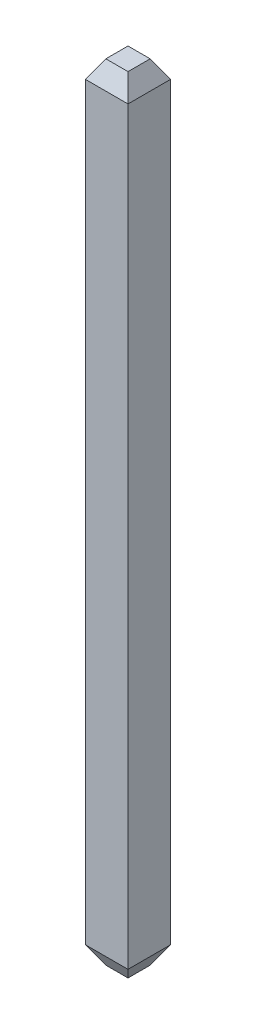
ISO-10303-21;
HEADER;
FILE_DESCRIPTION(('STEP AP214'),'2;1');
FILE_NAME('part.step','',(''),(''),'','','');
FILE_SCHEMA(('AUTOMOTIVE_DESIGN { 1 0 10303 214 1 1 1 1 }'));
ENDSEC;
DATA;
#1=APPLICATION_CONTEXT('core data for automotive mechanical design processes');
#2=APPLICATION_PROTOCOL_DEFINITION('international standard','automotive_design',2000,#1);
#3=PRODUCT_CONTEXT('',#1,'mechanical');
#4=PRODUCT('Part','Part','',(#3));
#5=PRODUCT_RELATED_PRODUCT_CATEGORY('part','',(#4));
#6=PRODUCT_DEFINITION_FORMATION('','',#4);
#7=PRODUCT_DEFINITION_CONTEXT('part definition',#1,'design');
#8=PRODUCT_DEFINITION('design','',#6,#7);
#9=PRODUCT_DEFINITION_SHAPE('','',#8);
#10=(LENGTH_UNIT() NAMED_UNIT(*) SI_UNIT(.MILLI.,.METRE.));
#11=(NAMED_UNIT(*) PLANE_ANGLE_UNIT() SI_UNIT($,.RADIAN.));
#12=(NAMED_UNIT(*) SI_UNIT($,.STERADIAN.) SOLID_ANGLE_UNIT());
#13=UNCERTAINTY_MEASURE_WITH_UNIT(LENGTH_MEASURE(1.E-05),#10,'distance_accuracy_value','');
#14=(GEOMETRIC_REPRESENTATION_CONTEXT(3) GLOBAL_UNCERTAINTY_ASSIGNED_CONTEXT((#13)) GLOBAL_UNIT_ASSIGNED_CONTEXT((#10,
#11,#12)) REPRESENTATION_CONTEXT('',''));
#15=CARTESIAN_POINT('',(0.,0.,0.));
#16=DIRECTION('',(0.,0.,1.));
#17=DIRECTION('',(1.,0.,0.));
#18=AXIS2_PLACEMENT_3D('',#15,#16,#17);
#19=CARTESIAN_POINT('',(4.7625,-5.58,1.105));
#20=DIRECTION('',(0.,0.50000000000019,0.866025403784329));
#21=DIRECTION('',(1.,0.,0.));
#22=AXIS2_PLACEMENT_3D('',#19,#20,#21);
#23=PLANE('',#22);
#24=DIRECTION('',(-0.44721359550015,0.774596669241261,-0.44721359550015));
#25=VECTOR('',#24,1.);
#26=CARTESIAN_POINT('',(4.915,-5.58,1.105));
#27=LINE('',#26,#25);
#28=CARTESIAN_POINT('',(4.915,-5.58,1.105));
#29=VERTEX_POINT('',#28);
#30=CARTESIAN_POINT('',(4.7625,-5.31586225185,0.9525));
#31=VERTEX_POINT('',#30);
#32=EDGE_CURVE('E168',#29,#31,#27,.T.);
#33=ORIENTED_EDGE('',*,*,#32,.T.);
#34=DIRECTION('',(1.,0.,0.));
#35=VECTOR('',#34,1.);
#36=CARTESIAN_POINT('',(4.7625,-5.31586225185,0.9525));
#37=LINE('',#36,#35);
#38=CARTESIAN_POINT('',(5.3975,-5.31586225185,0.9525));
#39=VERTEX_POINT('',#38);
#40=EDGE_CURVE('E123',#31,#39,#37,.T.);
#41=ORIENTED_EDGE('',*,*,#40,.T.);
#42=DIRECTION('',(0.44721359550015,0.774596669241261,-0.44721359550015));
#43=VECTOR('',#42,1.);
#44=CARTESIAN_POINT('',(5.245,-5.58,1.105));
#45=LINE('',#44,#43);
#46=CARTESIAN_POINT('',(5.245,-5.58,1.105));
#47=VERTEX_POINT('',#46);
#48=EDGE_CURVE('E27',#47,#39,#45,.T.);
#49=ORIENTED_EDGE('',*,*,#48,.F.);
#50=DIRECTION('',(1.,0.,0.));
#51=VECTOR('',#50,1.);
#52=CARTESIAN_POINT('',(4.915,-5.58,1.105));
#53=LINE('',#52,#51);
#54=EDGE_CURVE('E158',#29,#47,#53,.T.);
#55=ORIENTED_EDGE('',*,*,#54,.F.);
#56=EDGE_LOOP('',(#33,#41,#49,#55));
#57=FACE_BOUND('',#56,.T.);
#58=ADVANCED_FACE('F16',(#57),#23,.F.);
#59=CARTESIAN_POINT('',(5.3975,-5.58,1.435));
#60=DIRECTION('',(0.,0.50000000000019,-0.866025403784329));
#61=DIRECTION('',(-1.,0.,0.));
#62=AXIS2_PLACEMENT_3D('',#59,#60,#61);
#63=PLANE('',#62);
#64=DIRECTION('',(0.44721359550015,0.774596669241261,0.44721359550015));
#65=VECTOR('',#64,1.);
#66=CARTESIAN_POINT('',(5.245,-5.58,1.435));
#67=LINE('',#66,#65);
#68=CARTESIAN_POINT('',(5.245,-5.58,1.435));
#69=VERTEX_POINT('',#68);
#70=CARTESIAN_POINT('',(5.3975,-5.31586225185,1.5875));
#71=VERTEX_POINT('',#70);
#72=EDGE_CURVE('E11',#69,#71,#67,.T.);
#73=ORIENTED_EDGE('',*,*,#72,.T.);
#74=DIRECTION('',(-1.,0.,0.));
#75=VECTOR('',#74,1.);
#76=CARTESIAN_POINT('',(5.3975,-5.31586225185,1.5875));
#77=LINE('',#76,#75);
#78=CARTESIAN_POINT('',(4.7625,-5.31586225185,1.5875));
#79=VERTEX_POINT('',#78);
#80=EDGE_CURVE('E196',#71,#79,#77,.T.);
#81=ORIENTED_EDGE('',*,*,#80,.T.);
#82=DIRECTION('',(-0.44721359550015,0.774596669241261,0.44721359550015));
#83=VECTOR('',#82,1.);
#84=CARTESIAN_POINT('',(4.915,-5.58,1.435));
#85=LINE('',#84,#83);
#86=CARTESIAN_POINT('',(4.915,-5.58,1.435));
#87=VERTEX_POINT('',#86);
#88=EDGE_CURVE('E172',#87,#79,#85,.T.);
#89=ORIENTED_EDGE('',*,*,#88,.F.);
#90=DIRECTION('',(-1.,0.,0.));
#91=VECTOR('',#90,1.);
#92=CARTESIAN_POINT('',(5.245,-5.58,1.435));
#93=LINE('',#92,#91);
#94=EDGE_CURVE('E163',#69,#87,#93,.T.);
#95=ORIENTED_EDGE('',*,*,#94,.F.);
#96=EDGE_LOOP('',(#73,#81,#89,#95));
#97=FACE_BOUND('',#96,.T.);
#98=ADVANCED_FACE('F238',(#97),#63,.F.);
#99=CARTESIAN_POINT('',(5.245,-5.58,0.9525));
#100=DIRECTION('',(-0.866025403784329,0.50000000000019,0.));
#101=DIRECTION('',(0.,0.,1.));
#102=AXIS2_PLACEMENT_3D('',#99,#100,#101);
#103=PLANE('',#102);
#104=ORIENTED_EDGE('',*,*,#48,.T.);
#105=DIRECTION('',(0.,0.,1.));
#106=VECTOR('',#105,1.);
#107=CARTESIAN_POINT('',(5.3975,-5.31586225185,0.9525));
#108=LINE('',#107,#106);
#109=EDGE_CURVE('E119',#39,#71,#108,.T.);
#110=ORIENTED_EDGE('',*,*,#109,.T.);
#111=ORIENTED_EDGE('',*,*,#72,.F.);
#112=DIRECTION('',(0.,0.,1.));
#113=VECTOR('',#112,1.);
#114=CARTESIAN_POINT('',(5.245,-5.58,1.105));
#115=LINE('',#114,#113);
#116=EDGE_CURVE('E162',#47,#69,#115,.T.);
#117=ORIENTED_EDGE('',*,*,#116,.F.);
#118=EDGE_LOOP('',(#104,#110,#111,#117));
#119=FACE_BOUND('',#118,.T.);
#120=ADVANCED_FACE('F240',(#119),#103,.F.);
#121=CARTESIAN_POINT('',(5.08,-5.58,1.27));
#122=DIRECTION('',(0.,-1.,0.));
#123=DIRECTION('',(0.,0.,-1.));
#124=AXIS2_PLACEMENT_3D('',#121,#122,#123);
#125=PLANE('',#124);
#126=ORIENTED_EDGE('',*,*,#94,.T.);
#127=DIRECTION('',(0.,0.,-1.));
#128=VECTOR('',#127,1.);
#129=CARTESIAN_POINT('',(4.915,-5.58,1.435));
#130=LINE('',#129,#128);
#131=EDGE_CURVE('E171',#87,#29,#130,.T.);
#132=ORIENTED_EDGE('',*,*,#131,.T.);
#133=ORIENTED_EDGE('',*,*,#54,.T.);
#134=ORIENTED_EDGE('',*,*,#116,.T.);
#135=EDGE_LOOP('',(#126,#132,#133,#134));
#136=FACE_BOUND('',#135,.T.);
#137=ADVANCED_FACE('F297',(#136),#125,.T.);
#138=CARTESIAN_POINT('',(4.915,-5.58,1.5875));
#139=DIRECTION('',(0.866025403784329,0.50000000000019,0.));
#140=DIRECTION('',(0.,0.,-1.));
#141=AXIS2_PLACEMENT_3D('',#138,#139,#140);
#142=PLANE('',#141);
#143=ORIENTED_EDGE('',*,*,#88,.T.);
#144=DIRECTION('',(0.,0.,-1.));
#145=VECTOR('',#144,1.);
#146=CARTESIAN_POINT('',(4.7625,-5.31586225185,1.5875));
#147=LINE('',#146,#145);
#148=EDGE_CURVE('E181',#79,#31,#147,.T.);
#149=ORIENTED_EDGE('',*,*,#148,.T.);
#150=ORIENTED_EDGE('',*,*,#32,.F.);
#151=ORIENTED_EDGE('',*,*,#131,.F.);
#152=EDGE_LOOP('',(#143,#149,#150,#151));
#153=FACE_BOUND('',#152,.T.);
#154=ADVANCED_FACE('F317',(#153),#142,.F.);
#155=CARTESIAN_POINT('',(4.7625,6.1,1.5875));
#156=DIRECTION('',(-1.,0.,0.));
#157=DIRECTION('',(0.,0.,1.));
#158=AXIS2_PLACEMENT_3D('',#155,#156,#157);
#159=PLANE('',#158);
#160=DIRECTION('',(0.,-1.,0.));
#161=VECTOR('',#160,1.);
#162=CARTESIAN_POINT('',(4.7625,5.835862251846,0.9525));
#163=LINE('',#162,#161);
#164=CARTESIAN_POINT('',(4.7625,5.835862251846,0.9525));
#165=VERTEX_POINT('',#164);
#166=EDGE_CURVE('E128',#165,#31,#163,.T.);
#167=ORIENTED_EDGE('',*,*,#166,.T.);
#168=ORIENTED_EDGE('',*,*,#148,.F.);
#169=DIRECTION('',(0.,-1.,0.));
#170=VECTOR('',#169,1.);
#171=CARTESIAN_POINT('',(4.7625,5.835862251846,1.5875));
#172=LINE('',#171,#170);
#173=CARTESIAN_POINT('',(4.7625,5.835862251846,1.5875));
#174=VERTEX_POINT('',#173);
#175=EDGE_CURVE('E20',#174,#79,#172,.T.);
#176=ORIENTED_EDGE('',*,*,#175,.F.);
#177=DIRECTION('',(0.,0.,-1.));
#178=VECTOR('',#177,1.);
#179=CARTESIAN_POINT('',(4.7625,5.835862251846,1.5875));
#180=LINE('',#179,#178);
#181=EDGE_CURVE('E167',#174,#165,#180,.T.);
#182=ORIENTED_EDGE('',*,*,#181,.T.);
#183=EDGE_LOOP('',(#167,#168,#176,#182));
#184=FACE_BOUND('',#183,.T.);
#185=ADVANCED_FACE('F314',(#184),#159,.T.);
#186=CARTESIAN_POINT('',(4.7625,6.1,0.9525));
#187=DIRECTION('',(0.,0.,-1.));
#188=DIRECTION('',(0.,-1.,0.));
#189=AXIS2_PLACEMENT_3D('',#186,#187,#188);
#190=PLANE('',#189);
#191=DIRECTION('',(0.,-1.,0.));
#192=VECTOR('',#191,1.);
#193=CARTESIAN_POINT('',(5.3975,5.835862251846,0.9525));
#194=LINE('',#193,#192);
#195=CARTESIAN_POINT('',(5.3975,5.835862251846,0.9525));
#196=VERTEX_POINT('',#195);
#197=EDGE_CURVE('E113',#196,#39,#194,.T.);
#198=ORIENTED_EDGE('',*,*,#197,.T.);
#199=ORIENTED_EDGE('',*,*,#40,.F.);
#200=ORIENTED_EDGE('',*,*,#166,.F.);
#201=DIRECTION('',(1.,0.,0.));
#202=VECTOR('',#201,1.);
#203=CARTESIAN_POINT('',(4.7625,5.835862251846,0.9525));
#204=LINE('',#203,#202);
#205=EDGE_CURVE('E125',#165,#196,#204,.T.);
#206=ORIENTED_EDGE('',*,*,#205,.T.);
#207=EDGE_LOOP('',(#198,#199,#200,#206));
#208=FACE_BOUND('',#207,.T.);
#209=ADVANCED_FACE('F126',(#208),#190,.T.);
#210=CARTESIAN_POINT('',(5.3975,6.1,0.9525));
#211=DIRECTION('',(1.,0.,0.));
#212=DIRECTION('',(0.,1.,0.));
#213=AXIS2_PLACEMENT_3D('',#210,#211,#212);
#214=PLANE('',#213);
#215=DIRECTION('',(0.,-1.,0.));
#216=VECTOR('',#215,1.);
#217=CARTESIAN_POINT('',(5.3975,5.835862251846,1.5875));
#218=LINE('',#217,#216);
#219=CARTESIAN_POINT('',(5.3975,5.835862251846,1.5875));
#220=VERTEX_POINT('',#219);
#221=EDGE_CURVE('E105',#220,#71,#218,.T.);
#222=ORIENTED_EDGE('',*,*,#221,.T.);
#223=ORIENTED_EDGE('',*,*,#109,.F.);
#224=ORIENTED_EDGE('',*,*,#197,.F.);
#225=DIRECTION('',(0.,0.,1.));
#226=VECTOR('',#225,1.);
#227=CARTESIAN_POINT('',(5.3975,5.835862251846,0.9525));
#228=LINE('',#227,#226);
#229=EDGE_CURVE('E116',#196,#220,#228,.T.);
#230=ORIENTED_EDGE('',*,*,#229,.T.);
#231=EDGE_LOOP('',(#222,#223,#224,#230));
#232=FACE_BOUND('',#231,.T.);
#233=ADVANCED_FACE('F115',(#232),#214,.T.);
#234=CARTESIAN_POINT('',(5.3975,6.1,1.5875));
#235=DIRECTION('',(0.,0.,1.));
#236=DIRECTION('',(1.,0.,0.));
#237=AXIS2_PLACEMENT_3D('',#234,#235,#236);
#238=PLANE('',#237);
#239=ORIENTED_EDGE('',*,*,#175,.T.);
#240=ORIENTED_EDGE('',*,*,#80,.F.);
#241=ORIENTED_EDGE('',*,*,#221,.F.);
#242=DIRECTION('',(-1.,0.,0.));
#243=VECTOR('',#242,1.);
#244=CARTESIAN_POINT('',(5.3975,5.835862251846,1.5875));
#245=LINE('',#244,#243);
#246=EDGE_CURVE('E148',#220,#174,#245,.T.);
#247=ORIENTED_EDGE('',*,*,#246,.T.);
#248=EDGE_LOOP('',(#239,#240,#241,#247));
#249=FACE_BOUND('',#248,.T.);
#250=ADVANCED_FACE('F226',(#249),#238,.T.);
#251=CARTESIAN_POINT('',(5.3975,6.1,1.435));
#252=DIRECTION('',(0.,0.50000000000019,0.866025403784329));
#253=DIRECTION('',(1.,0.,0.));
#254=AXIS2_PLACEMENT_3D('',#251,#252,#253);
#255=PLANE('',#254);
#256=DIRECTION('',(-0.44721359550015,-0.774596669241261,0.44721359550015));
#257=VECTOR('',#256,1.);
#258=CARTESIAN_POINT('',(4.915,6.1,1.435));
#259=LINE('',#258,#257);
#260=CARTESIAN_POINT('',(4.915,6.1,1.435));
#261=VERTEX_POINT('',#260);
#262=EDGE_CURVE('E151',#261,#174,#259,.T.);
#263=ORIENTED_EDGE('',*,*,#262,.T.);
#264=ORIENTED_EDGE('',*,*,#246,.F.);
#265=DIRECTION('',(0.44721359550015,-0.774596669241261,0.44721359550015));
#266=VECTOR('',#265,1.);
#267=CARTESIAN_POINT('',(5.245,6.1,1.435));
#268=LINE('',#267,#266);
#269=CARTESIAN_POINT('',(5.245,6.1,1.435));
#270=VERTEX_POINT('',#269);
#271=EDGE_CURVE('E137',#270,#220,#268,.T.);
#272=ORIENTED_EDGE('',*,*,#271,.F.);
#273=DIRECTION('',(-1.,0.,0.));
#274=VECTOR('',#273,1.);
#275=CARTESIAN_POINT('',(5.245,6.1,1.435));
#276=LINE('',#275,#274);
#277=EDGE_CURVE('E155',#270,#261,#276,.T.);
#278=ORIENTED_EDGE('',*,*,#277,.T.);
#279=EDGE_LOOP('',(#263,#264,#272,#278));
#280=FACE_BOUND('',#279,.T.);
#281=ADVANCED_FACE('F223',(#280),#255,.T.);
#282=CARTESIAN_POINT('',(4.915,6.1,1.5875));
#283=DIRECTION('',(-0.866025403784329,0.50000000000019,0.));
#284=DIRECTION('',(0.,0.,1.));
#285=AXIS2_PLACEMENT_3D('',#282,#283,#284);
#286=PLANE('',#285);
#287=DIRECTION('',(-0.44721359550015,-0.774596669241261,-0.44721359550015));
#288=VECTOR('',#287,1.);
#289=CARTESIAN_POINT('',(4.915,6.1,1.105));
#290=LINE('',#289,#288);
#291=CARTESIAN_POINT('',(4.915,6.1,1.105));
#292=VERTEX_POINT('',#291);
#293=EDGE_CURVE('E91',#292,#165,#290,.T.);
#294=ORIENTED_EDGE('',*,*,#293,.T.);
#295=ORIENTED_EDGE('',*,*,#181,.F.);
#296=ORIENTED_EDGE('',*,*,#262,.F.);
#297=DIRECTION('',(0.,0.,-1.));
#298=VECTOR('',#297,1.);
#299=CARTESIAN_POINT('',(4.915,6.1,1.435));
#300=LINE('',#299,#298);
#301=EDGE_CURVE('E152',#261,#292,#300,.T.);
#302=ORIENTED_EDGE('',*,*,#301,.T.);
#303=EDGE_LOOP('',(#294,#295,#296,#302));
#304=FACE_BOUND('',#303,.T.);
#305=ADVANCED_FACE('F301',(#304),#286,.T.);
#306=CARTESIAN_POINT('',(4.7625,6.1,1.105));
#307=DIRECTION('',(0.,0.50000000000019,-0.866025403784329));
#308=DIRECTION('',(-1.,0.,0.));
#309=AXIS2_PLACEMENT_3D('',#306,#307,#308);
#310=PLANE('',#309);
#311=DIRECTION('',(0.44721359550015,-0.774596669241261,-0.44721359550015));
#312=VECTOR('',#311,1.);
#313=CARTESIAN_POINT('',(5.245,6.1,1.105));
#314=LINE('',#313,#312);
#315=CARTESIAN_POINT('',(5.245,6.1,1.105));
#316=VERTEX_POINT('',#315);
#317=EDGE_CURVE('E77',#316,#196,#314,.T.);
#318=ORIENTED_EDGE('',*,*,#317,.T.);
#319=ORIENTED_EDGE('',*,*,#205,.F.);
#320=ORIENTED_EDGE('',*,*,#293,.F.);
#321=DIRECTION('',(1.,0.,0.));
#322=VECTOR('',#321,1.);
#323=CARTESIAN_POINT('',(4.915,6.1,1.105));
#324=LINE('',#323,#322);
#325=EDGE_CURVE('E134',#292,#316,#324,.T.);
#326=ORIENTED_EDGE('',*,*,#325,.T.);
#327=EDGE_LOOP('',(#318,#319,#320,#326));
#328=FACE_BOUND('',#327,.T.);
#329=ADVANCED_FACE('F132',(#328),#310,.T.);
#330=CARTESIAN_POINT('',(5.245,6.1,0.9525));
#331=DIRECTION('',(0.866025403784329,0.50000000000019,0.));
#332=DIRECTION('',(0.,0.,-1.));
#333=AXIS2_PLACEMENT_3D('',#330,#331,#332);
#334=PLANE('',#333);
#335=ORIENTED_EDGE('',*,*,#271,.T.);
#336=ORIENTED_EDGE('',*,*,#229,.F.);
#337=ORIENTED_EDGE('',*,*,#317,.F.);
#338=DIRECTION('',(0.,0.,1.));
#339=VECTOR('',#338,1.);
#340=CARTESIAN_POINT('',(5.245,6.1,1.105));
#341=LINE('',#340,#339);
#342=EDGE_CURVE('E144',#316,#270,#341,.T.);
#343=ORIENTED_EDGE('',*,*,#342,.T.);
#344=EDGE_LOOP('',(#335,#336,#337,#343));
#345=FACE_BOUND('',#344,.T.);
#346=ADVANCED_FACE('F18',(#345),#334,.T.);
#347=CARTESIAN_POINT('',(5.08,6.1,1.27));
#348=DIRECTION('',(0.,-1.,0.));
#349=DIRECTION('',(0.,0.,-1.));
#350=AXIS2_PLACEMENT_3D('',#347,#348,#349);
#351=PLANE('',#350);
#352=ORIENTED_EDGE('',*,*,#325,.F.);
#353=ORIENTED_EDGE('',*,*,#301,.F.);
#354=ORIENTED_EDGE('',*,*,#277,.F.);
#355=ORIENTED_EDGE('',*,*,#342,.F.);
#356=EDGE_LOOP('',(#352,#353,#354,#355));
#357=FACE_BOUND('',#356,.T.);
#358=ADVANCED_FACE('F221',(#357),#351,.F.);
#359=CLOSED_SHELL('',(#58,#98,#120,#137,#154,#185,#209,#233,#250,#281,#305,#329,#346,#358));
#360=MANIFOLD_SOLID_BREP('B1',#359);
#361=ADVANCED_BREP_SHAPE_REPRESENTATION('',(#18,#360),#14);
#362=SHAPE_DEFINITION_REPRESENTATION(#9,#361);
ENDSEC;
END-ISO-10303-21;
